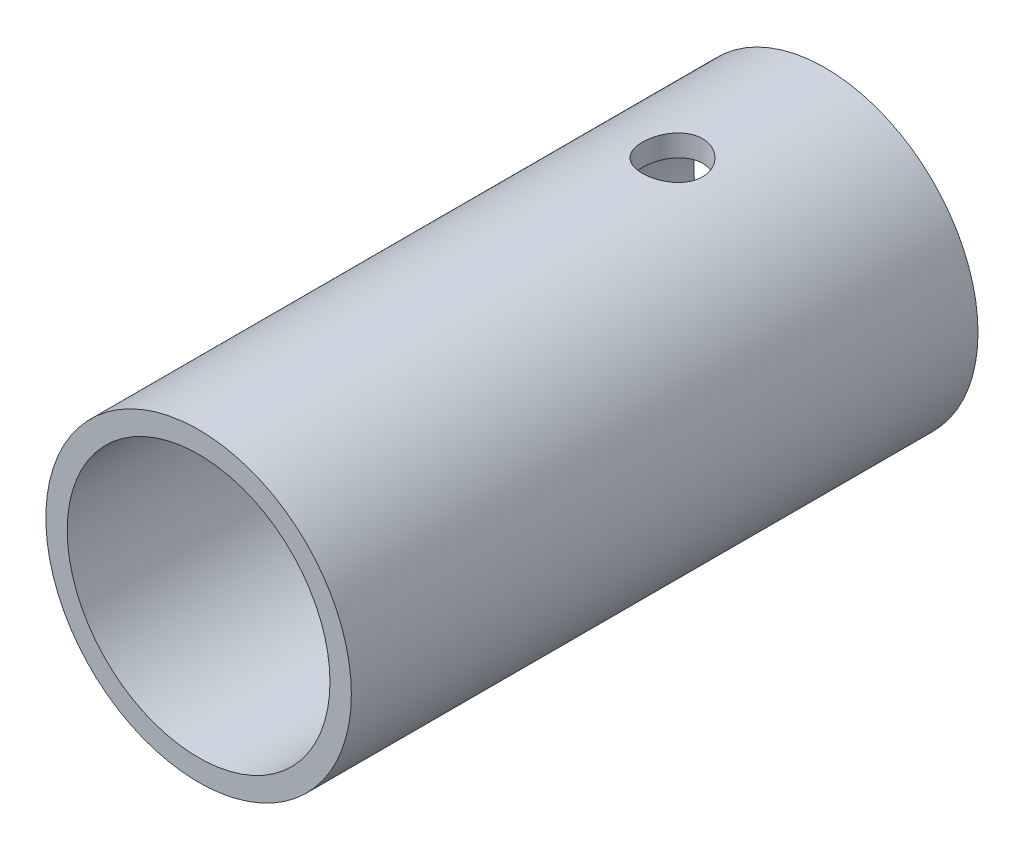
ISO-10303-21;
HEADER;
FILE_DESCRIPTION(('STEP AP214'),'2;1');
FILE_NAME('part.step','',(''),(''),'','','');
FILE_SCHEMA(('AUTOMOTIVE_DESIGN { 1 0 10303 214 1 1 1 1 }'));
ENDSEC;
DATA;
#1=APPLICATION_CONTEXT('core data for automotive mechanical design processes');
#2=APPLICATION_PROTOCOL_DEFINITION('international standard','automotive_design',2000,#1);
#3=PRODUCT_CONTEXT('',#1,'mechanical');
#4=PRODUCT('Part','Part','',(#3));
#5=PRODUCT_RELATED_PRODUCT_CATEGORY('part','',(#4));
#6=PRODUCT_DEFINITION_FORMATION('','',#4);
#7=PRODUCT_DEFINITION_CONTEXT('part definition',#1,'design');
#8=PRODUCT_DEFINITION('design','',#6,#7);
#9=PRODUCT_DEFINITION_SHAPE('','',#8);
#10=(LENGTH_UNIT() NAMED_UNIT(*) SI_UNIT(.MILLI.,.METRE.));
#11=(NAMED_UNIT(*) PLANE_ANGLE_UNIT() SI_UNIT($,.RADIAN.));
#12=(NAMED_UNIT(*) SI_UNIT($,.STERADIAN.) SOLID_ANGLE_UNIT());
#13=UNCERTAINTY_MEASURE_WITH_UNIT(LENGTH_MEASURE(1.E-05),#10,'distance_accuracy_value','');
#14=(GEOMETRIC_REPRESENTATION_CONTEXT(3) GLOBAL_UNCERTAINTY_ASSIGNED_CONTEXT((#13)) GLOBAL_UNIT_ASSIGNED_CONTEXT((#10,
#11,#12)) REPRESENTATION_CONTEXT('',''));
#15=CARTESIAN_POINT('',(0.,0.,0.));
#16=DIRECTION('',(0.,0.,1.));
#17=DIRECTION('',(1.,0.,0.));
#18=AXIS2_PLACEMENT_3D('',#15,#16,#17);
#19=CARTESIAN_POINT('',(0.,0.,26.05));
#20=DIRECTION('',(0.,0.,-1.));
#21=DIRECTION('',(-1.,0.,0.));
#22=AXIS2_PLACEMENT_3D('',#19,#20,#21);
#23=CYLINDRICAL_SURFACE('',#22,5.461);
#24=CARTESIAN_POINT('',(0.,-5.46100000000001,7.6));
#25=CARTESIAN_POINT('',(0.0692457304093979,-5.46099874087451,7.59999775463749));
#26=CARTESIAN_POINT('',(0.138517917481372,-5.45966963785508,7.59422662529338));
#27=CARTESIAN_POINT('',(0.275089103102907,-5.45449607675566,7.57132184101614));
#28=CARTESIAN_POINT('',(0.342386751278668,-5.45064993734101,7.55418059094452));
#29=CARTESIAN_POINT('',(0.473015872314505,-5.44086981712063,7.50910495423509));
#30=CARTESIAN_POINT('',(0.536351595977743,-5.43493812081846,7.48118237411362));
#31=CARTESIAN_POINT('',(0.657438015900284,-5.42162442736846,7.41537547000472));
#32=CARTESIAN_POINT('',(0.715188750704366,-5.41424244023088,7.37749121477444));
#33=CARTESIAN_POINT('',(0.82447650621566,-5.39869036087309,7.29213617387875));
#34=CARTESIAN_POINT('',(0.875901975135973,-5.3905097315284,7.24452446735534));
#35=CARTESIAN_POINT('',(0.970111431612566,-5.37435527017592,7.1413683234903));
#36=CARTESIAN_POINT('',(1.01289458863818,-5.36638145810749,7.08582312461071));
#37=CARTESIAN_POINT('',(1.08910720100292,-5.3514388812638,6.96753905071696));
#38=CARTESIAN_POINT('',(1.12241602557579,-5.34448358193598,6.90472059724823));
#39=CARTESIAN_POINT('',(1.17796007296246,-5.33251757998939,6.77419196561299));
#40=CARTESIAN_POINT('',(1.20019675621223,-5.32750662092779,6.70648243393857));
#41=CARTESIAN_POINT('',(1.23259291293053,-5.32010430418265,6.56930909437199));
#42=CARTESIAN_POINT('',(1.24295087396149,-5.31766994767703,6.49989453450375));
#43=CARTESIAN_POINT('',(1.25191308717094,-5.31556746321273,6.36027355159557));
#44=CARTESIAN_POINT('',(1.2505189272519,-5.31589896154206,6.29006723681469));
#45=CARTESIAN_POINT('',(1.23617577678725,-5.31925188797384,6.15234518175253));
#46=CARTESIAN_POINT('',(1.2234591777551,-5.3222192132373,6.08480372026236));
#47=CARTESIAN_POINT('',(1.18720109366,-5.33042370130195,5.95283908310613));
#48=CARTESIAN_POINT('',(1.16365894976394,-5.33566100225075,5.88841609749154));
#49=CARTESIAN_POINT('',(1.10620950451899,-5.34786749660587,5.76387327501353));
#50=CARTESIAN_POINT('',(1.07221442046873,-5.35485126015337,5.70379541843003));
#51=CARTESIAN_POINT('',(0.994885703252607,-5.36975507663967,5.59011174005947));
#52=CARTESIAN_POINT('',(0.951550683210128,-5.37767526854873,5.536506881287));
#53=CARTESIAN_POINT('',(0.855550253438725,-5.39379033538472,5.4359547461058));
#54=CARTESIAN_POINT('',(0.802687683330887,-5.40198726644837,5.3891958329875));
#55=CARTESIAN_POINT('',(0.689776593786924,-5.41756144791183,5.30517449493217));
#56=CARTESIAN_POINT('',(0.629727919046999,-5.42493868058992,5.26791227528912));
#57=CARTESIAN_POINT('',(0.503907222708833,-5.43806989736707,5.20388858838159));
#58=CARTESIAN_POINT('',(0.438121252174394,-5.44381977237759,5.17715363716898));
#59=CARTESIAN_POINT('',(0.302829205076936,-5.45301813697197,5.13517125501178));
#60=CARTESIAN_POINT('',(0.233323724116886,-5.45646699383239,5.11992199073139));
#61=CARTESIAN_POINT('',(0.0941797247924995,-5.46062180327953,5.10162207278483));
#62=CARTESIAN_POINT('',(0.0245766918410836,-5.46138554494577,5.09831437007113));
#63=CARTESIAN_POINT('',(-0.114187571338293,-5.46024683718454,5.10329216804641));
#64=CARTESIAN_POINT('',(-0.183348834158985,-5.45834458678415,5.1115768033204));
#65=CARTESIAN_POINT('',(-0.318401688336348,-5.45212428474116,5.13929129093262));
#66=CARTESIAN_POINT('',(-0.384322778819328,-5.44783583860679,5.15858463166245));
#67=CARTESIAN_POINT('',(-0.511992114832848,-5.43732394951167,5.20761597429548));
#68=CARTESIAN_POINT('',(-0.573739981865165,-5.43110033132283,5.23735492207054));
#69=CARTESIAN_POINT('',(-0.692360557894485,-5.41726702859925,5.30695712885682));
#70=CARTESIAN_POINT('',(-0.749143573198132,-5.4096374795472,5.34696921150889));
#71=CARTESIAN_POINT('',(-0.855281291812154,-5.39387606258453,5.43578775410299));
#72=CARTESIAN_POINT('',(-0.904634930116684,-5.38574412289111,5.48459547270577));
#73=CARTESIAN_POINT('',(-0.995542841809516,-5.3696921532004,5.59080415457262));
#74=CARTESIAN_POINT('',(-1.03691832978869,-5.36177978270609,5.64835952855969));
#75=CARTESIAN_POINT('',(-1.10941852778197,-5.34725014987571,5.76975198412561));
#76=CARTESIAN_POINT('',(-1.14054369227436,-5.34063283012502,5.83358878703577));
#77=CARTESIAN_POINT('',(-1.1914405885398,-5.32950930966063,5.96538430019807));
#78=CARTESIAN_POINT('',(-1.21127803376253,-5.32499091854621,6.03331655259053));
#79=CARTESIAN_POINT('',(-1.23922394707071,-5.31855755267855,6.17166825307161));
#80=CARTESIAN_POINT('',(-1.2473344987592,-5.31664211544307,6.24208725704254));
#81=CARTESIAN_POINT('',(-1.25150124954501,-5.31566261851203,6.38160600707731));
#82=CARTESIAN_POINT('',(-1.24784156743073,-5.31653135063618,6.4506969446524));
#83=CARTESIAN_POINT('',(-1.22921160209537,-5.32086925335401,6.58724919802271));
#84=CARTESIAN_POINT('',(-1.2142414793508,-5.32433838705227,6.65471053692525));
#85=CARTESIAN_POINT('',(-1.17355864237312,-5.3334519384306,6.78583699798281));
#86=CARTESIAN_POINT('',(-1.14789101224763,-5.33908721933774,6.84951678537223));
#87=CARTESIAN_POINT('',(-1.08657919306808,-5.35190089708751,6.97170705573856));
#88=CARTESIAN_POINT('',(-1.05093385284106,-5.35907947196467,7.03021694121538));
#89=CARTESIAN_POINT('',(-0.969752249110381,-5.37436882210454,7.14179866283152));
#90=CARTESIAN_POINT('',(-0.924015130346111,-5.38249666889734,7.19472205436108));
#91=CARTESIAN_POINT('',(-0.824350570823062,-5.39865824941586,7.29223552075217));
#92=CARTESIAN_POINT('',(-0.770421227356022,-5.40669196080978,7.33682365430446));
#93=CARTESIAN_POINT('',(-0.65495953619564,-5.42189863405979,7.41702412707724));
#94=CARTESIAN_POINT('',(-0.593328245727544,-5.42905741910265,7.45249687824557));
#95=CARTESIAN_POINT('',(-0.464824302207179,-5.44156341007711,7.51252259100301));
#96=CARTESIAN_POINT('',(-0.397955900341481,-5.44691206697786,7.53708430366374));
#97=CARTESIAN_POINT('',(-0.275895370959802,-5.45429098184519,7.57043772601773));
#98=CARTESIAN_POINT('',(-0.221341062043646,-5.4567907646652,7.58150158282033));
#99=CARTESIAN_POINT('',(-0.111196819245909,-5.46014573591041,7.59628342753597));
#100=CARTESIAN_POINT('',(-0.0556069401734502,-5.4610010111254,7.60000180311101));
#101=CARTESIAN_POINT('',(0.,-5.46100000000001,7.6));
#102=B_SPLINE_CURVE_WITH_KNOTS('',3,(#24,#25,#26,#27,#28,#29,#30,#31,#32,#33,#34,#35,#36,#37,
#38,#39,#40,#41,#42,#43,#44,#45,#46,#47,#48,#49,#50,#51,#52,#53,#54,#55,#56,#57,#58,#59,#60,#61,
#62,#63,#64,#65,#66,#67,#68,#69,#70,#71,#72,#73,#74,#75,#76,#77,#78,#79,#80,#81,#82,#83,#84,#85,
#86,#87,#88,#89,#90,#91,#92,#93,#94,#95,#96,#97,#98,#99,#100,#101),.UNSPECIFIED.,.T.,.F.,(4,2,2,
2,2,2,2,2,2,2,2,2,2,2,2,2,2,2,2,2,2,2,2,2,2,2,2,2,2,2,2,2,2,2,2,2,2,2,4),(0.,0.207533576294529,
0.415205922948466,0.622651491957742,0.830095629180034,1.04079047440079,1.25150555788295,
1.46479435968321,1.67805502083773,1.88769775884494,2.09731217116631,2.30272098547644,
2.50814230244031,2.7153381533107,2.92256479168315,3.13471327027616,3.34686633458266,
3.55955040253601,3.77220051483659,3.98024496815231,4.18827389093553,4.39377756834804,
4.5992998593536,4.80798634857591,5.01670272470748,5.22965860143085,5.44260503485643,
5.65429873470198,5.86595481675345,6.0725404787352,6.27912320966188,6.48484397379315,
6.69058848263702,6.90087191494632,7.11120426211315,7.32458774693027,7.53779977964294,
7.70446588580648,7.87112319583503),.UNSPECIFIED.);
#103=CARTESIAN_POINT('',(0.,-5.46100000000001,7.6));
#104=VERTEX_POINT('',#103);
#105=EDGE_CURVE('E60',#104,#104,#102,.T.);
#106=ORIENTED_EDGE('',*,*,#105,.F.);
#107=EDGE_LOOP('',(#106));
#108=FACE_BOUND('',#107,.T.);
#109=CARTESIAN_POINT('',(0.,5.46099999999999,7.6));
#110=CARTESIAN_POINT('',(-0.0692457304093968,5.4609987408745,7.59999775463749));
#111=CARTESIAN_POINT('',(-0.138517917481371,5.45966963785508,7.59422662529338));
#112=CARTESIAN_POINT('',(-0.275089103102907,5.45449607675567,7.57132184101614));
#113=CARTESIAN_POINT('',(-0.342386751278668,5.45064993734101,7.55418059094452));
#114=CARTESIAN_POINT('',(-0.473015872314505,5.44086981712063,7.50910495423508));
#115=CARTESIAN_POINT('',(-0.536351595977744,5.43493812081846,7.48118237411362));
#116=CARTESIAN_POINT('',(-0.657438015900286,5.42162442736846,7.41537547000472));
#117=CARTESIAN_POINT('',(-0.715188750704367,5.41424244023088,7.37749121477444));
#118=CARTESIAN_POINT('',(-0.824476506215662,5.39869036087309,7.29213617387875));
#119=CARTESIAN_POINT('',(-0.875901975135974,5.3905097315284,7.24452446735533));
#120=CARTESIAN_POINT('',(-0.970111431612567,5.37435527017592,7.1413683234903));
#121=CARTESIAN_POINT('',(-1.01289458863819,5.36638145810749,7.08582312461071));
#122=CARTESIAN_POINT('',(-1.08910720100292,5.35143888126381,6.96753905071696));
#123=CARTESIAN_POINT('',(-1.12241602557579,5.34448358193598,6.90472059724823));
#124=CARTESIAN_POINT('',(-1.17796007296246,5.33251757998939,6.77419196561298));
#125=CARTESIAN_POINT('',(-1.20019675621223,5.32750662092779,6.70648243393857));
#126=CARTESIAN_POINT('',(-1.23259291293053,5.32010430418265,6.56930909437198));
#127=CARTESIAN_POINT('',(-1.24295087396149,5.31766994767703,6.49989453450375));
#128=CARTESIAN_POINT('',(-1.25191308717094,5.31556746321273,6.36027355159556));
#129=CARTESIAN_POINT('',(-1.2505189272519,5.31589896154206,6.29006723681469));
#130=CARTESIAN_POINT('',(-1.23617577678725,5.31925188797385,6.15234518175253));
#131=CARTESIAN_POINT('',(-1.2234591777551,5.3222192132373,6.08480372026236));
#132=CARTESIAN_POINT('',(-1.18720109365999,5.33042370130195,5.95283908310613));
#133=CARTESIAN_POINT('',(-1.16365894976394,5.33566100225075,5.88841609749154));
#134=CARTESIAN_POINT('',(-1.10620950451899,5.34786749660587,5.76387327501352));
#135=CARTESIAN_POINT('',(-1.07221442046873,5.35485126015337,5.70379541843003));
#136=CARTESIAN_POINT('',(-0.994885703252605,5.36975507663967,5.59011174005947));
#137=CARTESIAN_POINT('',(-0.951550683210127,5.37767526854873,5.536506881287));
#138=CARTESIAN_POINT('',(-0.855550253438724,5.39379033538472,5.4359547461058));
#139=CARTESIAN_POINT('',(-0.802687683330886,5.40198726644837,5.3891958329875));
#140=CARTESIAN_POINT('',(-0.689776593786924,5.41756144791183,5.30517449493217));
#141=CARTESIAN_POINT('',(-0.629727919046999,5.42493868058992,5.26791227528912));
#142=CARTESIAN_POINT('',(-0.503907222708833,5.43806989736707,5.20388858838159));
#143=CARTESIAN_POINT('',(-0.438121252174394,5.44381977237759,5.17715363716898));
#144=CARTESIAN_POINT('',(-0.302829205076936,5.45301813697197,5.13517125501178));
#145=CARTESIAN_POINT('',(-0.233323724116885,5.45646699383239,5.11992199073139));
#146=CARTESIAN_POINT('',(-0.0941797247924985,5.46062180327953,5.10162207278483));
#147=CARTESIAN_POINT('',(-0.024576691841082,5.46138554494577,5.09831437007113));
#148=CARTESIAN_POINT('',(0.114187571338296,5.46024683718454,5.10329216804641));
#149=CARTESIAN_POINT('',(0.183348834158988,5.45834458678415,5.1115768033204));
#150=CARTESIAN_POINT('',(0.318401688336351,5.45212428474115,5.13929129093262));
#151=CARTESIAN_POINT('',(0.384322778819332,5.44783583860679,5.15858463166245));
#152=CARTESIAN_POINT('',(0.511992114832852,5.43732394951167,5.20761597429548));
#153=CARTESIAN_POINT('',(0.57373998186517,5.43110033132283,5.23735492207054));
#154=CARTESIAN_POINT('',(0.692360557894489,5.41726702859925,5.30695712885682));
#155=CARTESIAN_POINT('',(0.749143573198136,5.4096374795472,5.34696921150889));
#156=CARTESIAN_POINT('',(0.855281291812158,5.39387606258453,5.43578775410299));
#157=CARTESIAN_POINT('',(0.904634930116688,5.38574412289111,5.48459547270578));
#158=CARTESIAN_POINT('',(0.99554284180952,5.3696921532004,5.59080415457263));
#159=CARTESIAN_POINT('',(1.0369183297887,5.36177978270609,5.64835952855969));
#160=CARTESIAN_POINT('',(1.10941852778198,5.3472501498757,5.76975198412562));
#161=CARTESIAN_POINT('',(1.14054369227437,5.34063283012502,5.83358878703577));
#162=CARTESIAN_POINT('',(1.1914405885398,5.32950930966063,5.96538430019808));
#163=CARTESIAN_POINT('',(1.21127803376254,5.32499091854621,6.03331655259053));
#164=CARTESIAN_POINT('',(1.23922394707071,5.31855755267855,6.17166825307161));
#165=CARTESIAN_POINT('',(1.24733449875921,5.31664211544307,6.24208725704255));
#166=CARTESIAN_POINT('',(1.25150124954501,5.31566261851203,6.38160600707732));
#167=CARTESIAN_POINT('',(1.24784156743073,5.31653135063618,6.4506969446524));
#168=CARTESIAN_POINT('',(1.22921160209537,5.32086925335401,6.58724919802271));
#169=CARTESIAN_POINT('',(1.2142414793508,5.32433838705227,6.65471053692525));
#170=CARTESIAN_POINT('',(1.17355864237312,5.3334519384306,6.78583699798281));
#171=CARTESIAN_POINT('',(1.14789101224763,5.33908721933774,6.84951678537223));
#172=CARTESIAN_POINT('',(1.08657919306808,5.35190089708751,6.97170705573856));
#173=CARTESIAN_POINT('',(1.05093385284107,5.35907947196467,7.03021694121538));
#174=CARTESIAN_POINT('',(0.969752249110383,5.37436882210454,7.14179866283152));
#175=CARTESIAN_POINT('',(0.924015130346114,5.38249666889734,7.19472205436108));
#176=CARTESIAN_POINT('',(0.824350570823065,5.39865824941586,7.29223552075217));
#177=CARTESIAN_POINT('',(0.770421227356025,5.40669196080977,7.33682365430446));
#178=CARTESIAN_POINT('',(0.654959536195642,5.42189863405979,7.41702412707724));
#179=CARTESIAN_POINT('',(0.593328245727547,5.42905741910265,7.45249687824557));
#180=CARTESIAN_POINT('',(0.464824302207182,5.44156341007711,7.51252259100301));
#181=CARTESIAN_POINT('',(0.397955900341484,5.44691206697786,7.53708430366374));
#182=CARTESIAN_POINT('',(0.275895370959804,5.45429098184519,7.57043772601773));
#183=CARTESIAN_POINT('',(0.221341062043648,5.4567907646652,7.58150158282033));
#184=CARTESIAN_POINT('',(0.111196819245911,5.46014573591041,7.59628342753597));
#185=CARTESIAN_POINT('',(0.0556069401734518,5.46100101112538,7.60000180311101));
#186=CARTESIAN_POINT('',(0.,5.46099999999999,7.6));
#187=B_SPLINE_CURVE_WITH_KNOTS('',3,(#109,#110,#111,#112,#113,#114,#115,#116,#117,#118,#119,
#120,#121,#122,#123,#124,#125,#126,#127,#128,#129,#130,#131,#132,#133,#134,#135,#136,#137,#138,
#139,#140,#141,#142,#143,#144,#145,#146,#147,#148,#149,#150,#151,#152,#153,#154,#155,#156,#157,
#158,#159,#160,#161,#162,#163,#164,#165,#166,#167,#168,#169,#170,#171,#172,#173,#174,#175,#176,
#177,#178,#179,#180,#181,#182,#183,#184,#185,#186),.UNSPECIFIED.,.T.,.F.,(4,2,2,2,2,2,2,2,2,2,2,
2,2,2,2,2,2,2,2,2,2,2,2,2,2,2,2,2,2,2,2,2,2,2,2,2,2,2,4),(0.,0.20753357629453,0.415205922948468,
0.622651491957744,0.830095629180038,1.04079047440079,1.25150555788296,1.46479435968322,
1.67805502083773,1.88769775884495,2.09731217116632,2.30272098547644,2.50814230244031,
2.7153381533107,2.92256479168315,3.13471327027615,3.34686633458266,3.559550402536,
3.77220051483658,3.98024496815231,4.18827389093553,4.39377756834804,4.5992998593536,
4.80798634857591,5.01670272470748,5.22965860143085,5.44260503485643,5.65429873470199,
5.86595481675345,6.0725404787352,6.27912320966188,6.48484397379315,6.69058848263702,
6.90087191494631,7.11120426211314,7.32458774693027,7.53779977964294,7.70446588580648,
7.87112319583503),.UNSPECIFIED.);
#188=CARTESIAN_POINT('',(0.,5.46099999999999,7.6));
#189=VERTEX_POINT('',#188);
#190=EDGE_CURVE('E81',#189,#189,#187,.T.);
#191=ORIENTED_EDGE('',*,*,#190,.F.);
#192=EDGE_LOOP('',(#191));
#193=FACE_BOUND('',#192,.T.);
#194=CARTESIAN_POINT('',(0.,0.,26.05));
#195=DIRECTION('',(0.,0.,1.));
#196=DIRECTION('',(1.,0.,0.));
#197=AXIS2_PLACEMENT_3D('',#194,#195,#196);
#198=CIRCLE('',#197,5.461);
#199=CARTESIAN_POINT('',(5.461,0.,26.05));
#200=VERTEX_POINT('',#199);
#201=EDGE_CURVE('E48',#200,#200,#198,.T.);
#202=ORIENTED_EDGE('',*,*,#201,.T.);
#203=EDGE_LOOP('',(#202));
#204=FACE_BOUND('',#203,.T.);
#205=CARTESIAN_POINT('',(0.,0.,0.));
#206=DIRECTION('',(0.,0.,1.));
#207=DIRECTION('',(1.,0.,0.));
#208=AXIS2_PLACEMENT_3D('',#205,#206,#207);
#209=CIRCLE('',#208,5.461);
#210=CARTESIAN_POINT('',(5.461,0.,0.));
#211=VERTEX_POINT('',#210);
#212=EDGE_CURVE('E57',#211,#211,#209,.T.);
#213=ORIENTED_EDGE('',*,*,#212,.F.);
#214=EDGE_LOOP('',(#213));
#215=FACE_BOUND('',#214,.T.);
#216=ADVANCED_FACE('F36',(#108,#193,#204,#215),#23,.F.);
#217=CARTESIAN_POINT('',(0.,0.,26.05));
#218=DIRECTION('',(0.,0.,-1.));
#219=DIRECTION('',(-1.,0.,0.));
#220=AXIS2_PLACEMENT_3D('',#217,#218,#219);
#221=CYLINDRICAL_SURFACE('',#220,6.35);
#222=CARTESIAN_POINT('',(0.,-6.35000000000001,7.6));
#223=CARTESIAN_POINT('',(0.0694939804326173,-6.34999872344056,7.59999741697149));
#224=CARTESIAN_POINT('',(0.139020856807098,-6.34884746695947,7.59418512233234));
#225=CARTESIAN_POINT('',(0.276110920333324,-6.34436590183971,7.57110707488042));
#226=CARTESIAN_POINT('',(0.343672476376257,-6.34103383426819,7.55383207667014));
#227=CARTESIAN_POINT('',(0.474829848521738,-6.33256289060586,7.5083817049578));
#228=CARTESIAN_POINT('',(0.538429341852969,-6.32742572017194,7.48021661907805));
#229=CARTESIAN_POINT('',(0.65999535360919,-6.31590367713382,7.41381579844673));
#230=CARTESIAN_POINT('',(0.717962238037103,-6.30951888568045,7.37558071863606));
#231=CARTESIAN_POINT('',(0.827384016512086,-6.29611102614492,7.28959245680302));
#232=CARTESIAN_POINT('',(0.878754225040864,-6.28908132948856,7.24173253360937));
#233=CARTESIAN_POINT('',(0.972791329937009,-6.2752244237706,7.13808265203321));
#234=CARTESIAN_POINT('',(1.01545756098707,-6.26839723022205,7.0822920879986));
#235=CARTESIAN_POINT('',(1.09123391279335,-6.25565368156531,6.96375820739051));
#236=CARTESIAN_POINT('',(1.12425674252627,-6.24974585984846,6.90095808890527));
#237=CARTESIAN_POINT('',(1.17924978458522,-6.23960391049848,6.7705652920754));
#238=CARTESIAN_POINT('',(1.20122105276671,-6.23536962298579,6.70297307226771));
#239=CARTESIAN_POINT('',(1.23321317099972,-6.22912114018685,6.56582462774841));
#240=CARTESIAN_POINT('',(1.24338237441819,-6.22707940916392,6.49630428882713));
#241=CARTESIAN_POINT('',(1.25194241392171,-6.22536429547634,6.35651652417689));
#242=CARTESIAN_POINT('',(1.25033441599248,-6.22569067835976,6.28624917309264));
#243=CARTESIAN_POINT('',(1.23550573337242,-6.22864988383405,6.14804466350049));
#244=CARTESIAN_POINT('',(1.22245476039046,-6.23124899784788,6.08008846659444));
#245=CARTESIAN_POINT('',(1.18537832222863,-6.23840776786276,5.94734938288738));
#246=CARTESIAN_POINT('',(1.16135234775692,-6.24296751484584,5.88256664350426));
#247=CARTESIAN_POINT('',(1.10284485747249,-6.25356844492135,5.75752240468413));
#248=CARTESIAN_POINT('',(1.06829575022772,-6.25961915520019,5.69729337201777));
#249=CARTESIAN_POINT('',(0.98977043624924,-6.27251408593659,5.58342386111392));
#250=CARTESIAN_POINT('',(0.945793178637779,-6.27935839481092,5.52978411837918));
#251=CARTESIAN_POINT('',(0.848749620379543,-6.29321559250291,5.42963621686989));
#252=CARTESIAN_POINT('',(0.795538391483495,-6.30022934156696,5.38326849889531));
#253=CARTESIAN_POINT('',(0.682019835627285,-6.31352591556468,5.30009527076996));
#254=CARTESIAN_POINT('',(0.621712423039483,-6.31980873167657,5.26328987602224));
#255=CARTESIAN_POINT('',(0.495559855492554,-6.33095024356266,5.20026145162072));
#256=CARTESIAN_POINT('',(0.429706667639597,-6.33580682618573,5.17405410291237));
#257=CARTESIAN_POINT('',(0.294415437445407,-6.34353255640573,5.13311343800312));
#258=CARTESIAN_POINT('',(0.224977816567588,-6.3464019370917,5.11837877608713));
#259=CARTESIAN_POINT('',(0.0856960204581709,-6.34979761511535,5.10099971472866));
#260=CARTESIAN_POINT('',(0.0158767138616839,-6.35036116751766,5.09816306115027));
#261=CARTESIAN_POINT('',(-0.123238319169051,-6.34918502460119,5.10414330556373));
#262=CARTESIAN_POINT('',(-0.192534073869589,-6.34744545453345,5.11295956983319));
#263=CARTESIAN_POINT('',(-0.328017411524043,-6.34188181040703,5.14183563304381));
#264=CARTESIAN_POINT('',(-0.394226758532902,-6.3380759676032,5.16179713777489));
#265=CARTESIAN_POINT('',(-0.522358707908788,-6.32880490671267,5.21228990537444));
#266=CARTESIAN_POINT('',(-0.584280996267093,-6.32333956723251,5.24282194150836));
#267=CARTESIAN_POINT('',(-0.702894389008581,-6.31126292459246,5.3140074630924));
#268=CARTESIAN_POINT('',(-0.759514422690815,-6.30463875071603,5.35477714131564));
#269=CARTESIAN_POINT('',(-0.865178401164781,-6.29101022941264,5.44512464324685));
#270=CARTESIAN_POINT('',(-0.9142215598671,-6.2840058426409,5.49470337973566));
#271=CARTESIAN_POINT('',(-1.00407868802173,-6.27028126377194,5.6021356229158));
#272=CARTESIAN_POINT('',(-1.04476087118854,-6.26356677403919,5.66010020991976));
#273=CARTESIAN_POINT('',(-1.11581163487924,-6.25130144140896,5.78215321541632));
#274=CARTESIAN_POINT('',(-1.14618062108291,-6.24575055274337,5.84624139290435));
#275=CARTESIAN_POINT('',(-1.19556121034271,-6.23648663322854,5.97840420204532));
#276=CARTESIAN_POINT('',(-1.21463070325767,-6.23276425161642,6.04645651749409));
#277=CARTESIAN_POINT('',(-1.24104736373123,-6.22755858712954,6.18488024343693));
#278=CARTESIAN_POINT('',(-1.24839600622804,-6.22607502252591,6.25525136099793));
#279=CARTESIAN_POINT('',(-1.25110911670658,-6.22553026233713,6.39499277196996));
#280=CARTESIAN_POINT('',(-1.24668173183846,-6.22642699327119,6.46435894429892));
#281=CARTESIAN_POINT('',(-1.22642690288144,-6.23044796366243,6.60133721493432));
#282=CARTESIAN_POINT('',(-1.21059954408838,-6.23357218645326,6.66894932636092));
#283=CARTESIAN_POINT('',(-1.16808561930223,-6.24167758718142,6.80037304713031));
#284=CARTESIAN_POINT('',(-1.14142381041251,-6.24665452942732,6.86419294325068));
#285=CARTESIAN_POINT('',(-1.07802140699671,-6.25790715548942,6.98648638961607));
#286=CARTESIAN_POINT('',(-1.04128000120944,-6.26418294383389,7.0449595090179));
#287=CARTESIAN_POINT('',(-0.958047153780955,-6.27745535581054,7.15593762567599));
#288=CARTESIAN_POINT('',(-0.911405090098395,-6.28446214955247,7.2083284614444));
#289=CARTESIAN_POINT('',(-0.810006714298531,-6.29833330286004,7.30460876853267));
#290=CARTESIAN_POINT('',(-0.755248540568527,-6.30519762933471,7.34849628408175));
#291=CARTESIAN_POINT('',(-0.638509398203907,-6.31809192156363,7.42694085549248));
#292=CARTESIAN_POINT('',(-0.576461177409874,-6.32411277788587,7.46139938409306));
#293=CARTESIAN_POINT('',(-0.447354677582576,-6.33455228311075,7.51934635102892));
#294=CARTESIAN_POINT('',(-0.38030102851324,-6.33897239107068,7.54284478497479));
#295=CARTESIAN_POINT('',(-0.260903753738919,-6.3448426925249,7.57359658768646));
#296=CARTESIAN_POINT('',(-0.209244697378744,-6.34676546742744,7.58348040451041));
#297=CARTESIAN_POINT('',(-0.105063344582429,-6.34934458466464,7.59668298824629));
#298=CARTESIAN_POINT('',(-0.0525410741960235,-6.35000096514554,7.60000195290429));
#299=CARTESIAN_POINT('',(0.,-6.35000000000001,7.6));
#300=B_SPLINE_CURVE_WITH_KNOTS('',3,(#222,#223,#224,#225,#226,#227,#228,#229,#230,#231,#232,
#233,#234,#235,#236,#237,#238,#239,#240,#241,#242,#243,#244,#245,#246,#247,#248,#249,#250,#251,
#252,#253,#254,#255,#256,#257,#258,#259,#260,#261,#262,#263,#264,#265,#266,#267,#268,#269,#270,
#271,#272,#273,#274,#275,#276,#277,#278,#279,#280,#281,#282,#283,#284,#285,#286,#287,#288,#289,
#290,#291,#292,#293,#294,#295,#296,#297,#298,#299),.UNSPECIFIED.,.T.,.F.,(4,2,2,2,2,2,2,2,2,2,2,
2,2,2,2,2,2,2,2,2,2,2,2,2,2,2,2,2,2,2,2,2,2,2,2,2,2,2,4),(0.,0.208289747189659,
0.416747697814534,0.625009202121,0.833257164680657,1.04395644558372,1.25467182595345,
1.46723931776153,1.67978649721884,1.88963196168972,2.09945665097822,2.3062210720878,
2.51299508901675,2.72112629808271,2.92928071788109,3.14105959839087,3.35284103463857,
3.56493468769528,3.77700345899184,3.98563198908576,4.19424917376995,4.40105490064573,
4.60787575916645,4.81715935266284,5.02646464445815,5.23885147330543,5.45122994673927,
5.66251073275074,5.87376492933512,6.08131002421398,6.28885356623402,6.49592550697449,
6.70301411889162,6.91351361259455,7.12406146403359,7.33673198768616,7.5492081746515,
7.70669083222362,7.86416874604055),.UNSPECIFIED.);
#301=CARTESIAN_POINT('',(0.,-6.35000000000001,7.6));
#302=VERTEX_POINT('',#301);
#303=EDGE_CURVE('E40',#302,#302,#300,.T.);
#304=ORIENTED_EDGE('',*,*,#303,.T.);
#305=EDGE_LOOP('',(#304));
#306=FACE_BOUND('',#305,.T.);
#307=CARTESIAN_POINT('',(0.,6.34999999999999,7.6));
#308=CARTESIAN_POINT('',(-0.0694939804326162,6.34999872344054,7.59999741697149));
#309=CARTESIAN_POINT('',(-0.139020856807098,6.34884746695946,7.59418512233234));
#310=CARTESIAN_POINT('',(-0.276110920333324,6.34436590183972,7.57110707488042));
#311=CARTESIAN_POINT('',(-0.343672476376258,6.34103383426819,7.55383207667014));
#312=CARTESIAN_POINT('',(-0.474829848521738,6.33256289060586,7.5083817049578));
#313=CARTESIAN_POINT('',(-0.538429341852969,6.32742572017194,7.48021661907805));
#314=CARTESIAN_POINT('',(-0.659995353609191,6.31590367713382,7.41381579844673));
#315=CARTESIAN_POINT('',(-0.717962238037104,6.30951888568045,7.37558071863606));
#316=CARTESIAN_POINT('',(-0.827384016512087,6.29611102614492,7.28959245680302));
#317=CARTESIAN_POINT('',(-0.878754225040865,6.28908132948856,7.24173253360937));
#318=CARTESIAN_POINT('',(-0.97279132993701,6.2752244237706,7.13808265203321));
#319=CARTESIAN_POINT('',(-1.01545756098707,6.26839723022205,7.0822920879986));
#320=CARTESIAN_POINT('',(-1.09123391279336,6.25565368156531,6.9637582073905));
#321=CARTESIAN_POINT('',(-1.12425674252627,6.24974585984846,6.90095808890527));
#322=CARTESIAN_POINT('',(-1.17924978458522,6.23960391049848,6.77056529207539));
#323=CARTESIAN_POINT('',(-1.20122105276671,6.23536962298579,6.7029730722677));
#324=CARTESIAN_POINT('',(-1.23321317099972,6.22912114018685,6.5658246277484));
#325=CARTESIAN_POINT('',(-1.24338237441819,6.22707940916393,6.49630428882713));
#326=CARTESIAN_POINT('',(-1.25194241392171,6.22536429547634,6.35651652417689));
#327=CARTESIAN_POINT('',(-1.25033441599247,6.22569067835976,6.28624917309264));
#328=CARTESIAN_POINT('',(-1.23550573337242,6.22864988383405,6.14804466350049));
#329=CARTESIAN_POINT('',(-1.22245476039046,6.23124899784788,6.08008846659444));
#330=CARTESIAN_POINT('',(-1.18537832222863,6.23840776786276,5.94734938288738));
#331=CARTESIAN_POINT('',(-1.16135234775691,6.24296751484584,5.88256664350426));
#332=CARTESIAN_POINT('',(-1.10284485747248,6.25356844492135,5.75752240468413));
#333=CARTESIAN_POINT('',(-1.06829575022772,6.25961915520019,5.69729337201777));
#334=CARTESIAN_POINT('',(-0.989770436249238,6.27251408593659,5.58342386111392));
#335=CARTESIAN_POINT('',(-0.945793178637777,6.27935839481092,5.52978411837918));
#336=CARTESIAN_POINT('',(-0.848749620379541,6.29321559250291,5.42963621686989));
#337=CARTESIAN_POINT('',(-0.795538391483493,6.30022934156696,5.38326849889531));
#338=CARTESIAN_POINT('',(-0.682019835627284,6.31352591556468,5.30009527076996));
#339=CARTESIAN_POINT('',(-0.621712423039483,6.31980873167657,5.26328987602224));
#340=CARTESIAN_POINT('',(-0.495559855492553,6.33095024356266,5.20026145162072));
#341=CARTESIAN_POINT('',(-0.429706667639596,6.33580682618573,5.17405410291237));
#342=CARTESIAN_POINT('',(-0.294415437445406,6.34353255640573,5.13311343800312));
#343=CARTESIAN_POINT('',(-0.224977816567587,6.3464019370917,5.11837877608713));
#344=CARTESIAN_POINT('',(-0.0856960204581697,6.34979761511535,5.10099971472866));
#345=CARTESIAN_POINT('',(-0.0158767138616824,6.35036116751766,5.09816306115027));
#346=CARTESIAN_POINT('',(0.123238319169053,6.34918502460119,5.10414330556373));
#347=CARTESIAN_POINT('',(0.192534073869592,6.34744545453345,5.11295956983319));
#348=CARTESIAN_POINT('',(0.328017411524046,6.34188181040703,5.14183563304381));
#349=CARTESIAN_POINT('',(0.394226758532905,6.3380759676032,5.16179713777489));
#350=CARTESIAN_POINT('',(0.522358707908791,6.32880490671267,5.21228990537444));
#351=CARTESIAN_POINT('',(0.584280996267097,6.32333956723251,5.24282194150836));
#352=CARTESIAN_POINT('',(0.702894389008585,6.31126292459246,5.3140074630924));
#353=CARTESIAN_POINT('',(0.759514422690819,6.30463875071603,5.35477714131565));
#354=CARTESIAN_POINT('',(0.865178401164785,6.29101022941264,5.44512464324686));
#355=CARTESIAN_POINT('',(0.914221559867104,6.2840058426409,5.49470337973567));
#356=CARTESIAN_POINT('',(1.00407868802173,6.27028126377194,5.6021356229158));
#357=CARTESIAN_POINT('',(1.04476087118855,6.26356677403919,5.66010020991976));
#358=CARTESIAN_POINT('',(1.11581163487925,6.25130144140895,5.78215321541632));
#359=CARTESIAN_POINT('',(1.14618062108292,6.24575055274337,5.84624139290435));
#360=CARTESIAN_POINT('',(1.19556121034271,6.23648663322854,5.97840420204532));
#361=CARTESIAN_POINT('',(1.21463070325767,6.23276425161642,6.0464565174941));
#362=CARTESIAN_POINT('',(1.24104736373124,6.22755858712954,6.18488024343693));
#363=CARTESIAN_POINT('',(1.24839600622804,6.2260750225259,6.25525136099793));
#364=CARTESIAN_POINT('',(1.25110911670658,6.22553026233713,6.39499277196996));
#365=CARTESIAN_POINT('',(1.24668173183846,6.22642699327119,6.46435894429892));
#366=CARTESIAN_POINT('',(1.22642690288144,6.23044796366243,6.60133721493432));
#367=CARTESIAN_POINT('',(1.21059954408838,6.23357218645326,6.66894932636092));
#368=CARTESIAN_POINT('',(1.16808561930223,6.24167758718142,6.80037304713031));
#369=CARTESIAN_POINT('',(1.14142381041251,6.24665452942732,6.86419294325068));
#370=CARTESIAN_POINT('',(1.07802140699671,6.25790715548942,6.98648638961607));
#371=CARTESIAN_POINT('',(1.04128000120944,6.26418294383389,7.0449595090179));
#372=CARTESIAN_POINT('',(0.958047153780957,6.27745535581054,7.15593762567599));
#373=CARTESIAN_POINT('',(0.911405090098397,6.28446214955247,7.2083284614444));
#374=CARTESIAN_POINT('',(0.810006714298533,6.29833330286004,7.30460876853267));
#375=CARTESIAN_POINT('',(0.75524854056853,6.30519762933471,7.34849628408175));
#376=CARTESIAN_POINT('',(0.63850939820391,6.31809192156363,7.42694085549248));
#377=CARTESIAN_POINT('',(0.576461177409876,6.32411277788587,7.46139938409306));
#378=CARTESIAN_POINT('',(0.447354677582579,6.33455228311075,7.51934635102892));
#379=CARTESIAN_POINT('',(0.380301028513243,6.33897239107068,7.54284478497479));
#380=CARTESIAN_POINT('',(0.260903753738922,6.3448426925249,7.57359658768646));
#381=CARTESIAN_POINT('',(0.209244697378747,6.34676546742744,7.58348040451041));
#382=CARTESIAN_POINT('',(0.105063344582432,6.34934458466464,7.59668298824629));
#383=CARTESIAN_POINT('',(0.0525410741960257,6.35000096514552,7.60000195290429));
#384=CARTESIAN_POINT('',(0.,6.34999999999999,7.6));
#385=B_SPLINE_CURVE_WITH_KNOTS('',3,(#307,#308,#309,#310,#311,#312,#313,#314,#315,#316,#317,
#318,#319,#320,#321,#322,#323,#324,#325,#326,#327,#328,#329,#330,#331,#332,#333,#334,#335,#336,
#337,#338,#339,#340,#341,#342,#343,#344,#345,#346,#347,#348,#349,#350,#351,#352,#353,#354,#355,
#356,#357,#358,#359,#360,#361,#362,#363,#364,#365,#366,#367,#368,#369,#370,#371,#372,#373,#374,
#375,#376,#377,#378,#379,#380,#381,#382,#383,#384),.UNSPECIFIED.,.T.,.F.,(4,2,2,2,2,2,2,2,2,2,2,
2,2,2,2,2,2,2,2,2,2,2,2,2,2,2,2,2,2,2,2,2,2,2,2,2,2,2,4),(0.,0.20828974718966,0.416747697814535,
0.625009202121003,0.83325716468066,1.04395644558372,1.25467182595346,1.46723931776154,
1.67978649721884,1.88963196168972,2.09945665097822,2.3062210720878,2.51299508901675,
2.72112629808271,2.92928071788109,3.14105959839087,3.35284103463857,3.56493468769528,
3.77700345899184,3.98563198908576,4.19424917376995,4.40105490064573,4.60787575916645,
4.81715935266284,5.02646464445816,5.23885147330544,5.45122994673928,5.66251073275075,
5.87376492933512,6.08131002421399,6.28885356623402,6.49592550697449,6.70301411889162,
6.91351361259455,7.12406146403359,7.33673198768616,7.5492081746515,7.70669083222363,
7.86416874604056),.UNSPECIFIED.);
#386=CARTESIAN_POINT('',(0.,6.34999999999999,7.6));
#387=VERTEX_POINT('',#386);
#388=EDGE_CURVE('E62',#387,#387,#385,.T.);
#389=ORIENTED_EDGE('',*,*,#388,.T.);
#390=EDGE_LOOP('',(#389));
#391=FACE_BOUND('',#390,.T.);
#392=CARTESIAN_POINT('',(0.,0.,26.05));
#393=DIRECTION('',(0.,0.,1.));
#394=DIRECTION('',(1.,0.,0.));
#395=AXIS2_PLACEMENT_3D('',#392,#393,#394);
#396=CIRCLE('',#395,6.35);
#397=CARTESIAN_POINT('',(6.35,0.,26.05));
#398=VERTEX_POINT('',#397);
#399=EDGE_CURVE('E10',#398,#398,#396,.T.);
#400=ORIENTED_EDGE('',*,*,#399,.F.);
#401=EDGE_LOOP('',(#400));
#402=FACE_BOUND('',#401,.T.);
#403=CARTESIAN_POINT('',(0.,0.,0.));
#404=DIRECTION('',(0.,0.,1.));
#405=DIRECTION('',(1.,0.,0.));
#406=AXIS2_PLACEMENT_3D('',#403,#404,#405);
#407=CIRCLE('',#406,6.35);
#408=CARTESIAN_POINT('',(6.35,0.,0.));
#409=VERTEX_POINT('',#408);
#410=EDGE_CURVE('E53',#409,#409,#407,.T.);
#411=ORIENTED_EDGE('',*,*,#410,.T.);
#412=EDGE_LOOP('',(#411));
#413=FACE_BOUND('',#412,.T.);
#414=ADVANCED_FACE('F67',(#306,#391,#402,#413),#221,.T.);
#415=CARTESIAN_POINT('',(0.,0.,26.05));
#416=DIRECTION('',(0.,0.,1.));
#417=DIRECTION('',(1.,0.,0.));
#418=AXIS2_PLACEMENT_3D('',#415,#416,#417);
#419=PLANE('',#418);
#420=ORIENTED_EDGE('',*,*,#201,.F.);
#421=EDGE_LOOP('',(#420));
#422=FACE_BOUND('',#421,.T.);
#423=ORIENTED_EDGE('',*,*,#399,.T.);
#424=EDGE_LOOP('',(#423));
#425=FACE_BOUND('',#424,.T.);
#426=ADVANCED_FACE('F76',(#422,#425),#419,.T.);
#427=CARTESIAN_POINT('',(0.,0.,0.));
#428=DIRECTION('',(0.,0.,1.));
#429=DIRECTION('',(1.,0.,0.));
#430=AXIS2_PLACEMENT_3D('',#427,#428,#429);
#431=PLANE('',#430);
#432=ORIENTED_EDGE('',*,*,#212,.T.);
#433=EDGE_LOOP('',(#432));
#434=FACE_BOUND('',#433,.T.);
#435=ORIENTED_EDGE('',*,*,#410,.F.);
#436=EDGE_LOOP('',(#435));
#437=FACE_BOUND('',#436,.T.);
#438=ADVANCED_FACE('F101',(#434,#437),#431,.F.);
#439=CARTESIAN_POINT('',(0.,-38.1,6.35));
#440=DIRECTION('',(0.,1.,0.));
#441=DIRECTION('',(0.,0.,1.));
#442=AXIS2_PLACEMENT_3D('',#439,#440,#441);
#443=CYLINDRICAL_SURFACE('',#442,1.25);
#444=ORIENTED_EDGE('',*,*,#190,.T.);
#445=EDGE_LOOP('',(#444));
#446=FACE_BOUND('',#445,.T.);
#447=ORIENTED_EDGE('',*,*,#388,.F.);
#448=EDGE_LOOP('',(#447));
#449=FACE_BOUND('',#448,.T.);
#450=ADVANCED_FACE('F74',(#446,#449),#443,.F.);
#451=ORIENTED_EDGE('',*,*,#105,.T.);
#452=EDGE_LOOP('',(#451));
#453=FACE_BOUND('',#452,.T.);
#454=ORIENTED_EDGE('',*,*,#303,.F.);
#455=EDGE_LOOP('',(#454));
#456=FACE_BOUND('',#455,.T.);
#457=ADVANCED_FACE('F70',(#453,#456),#443,.F.);
#458=CLOSED_SHELL('',(#216,#414,#426,#438,#450,#457));
#459=MANIFOLD_SOLID_BREP('B2',#458);
#460=ADVANCED_BREP_SHAPE_REPRESENTATION('',(#18,#459),#14);
#461=SHAPE_DEFINITION_REPRESENTATION(#9,#460);
ENDSEC;
END-ISO-10303-21;
